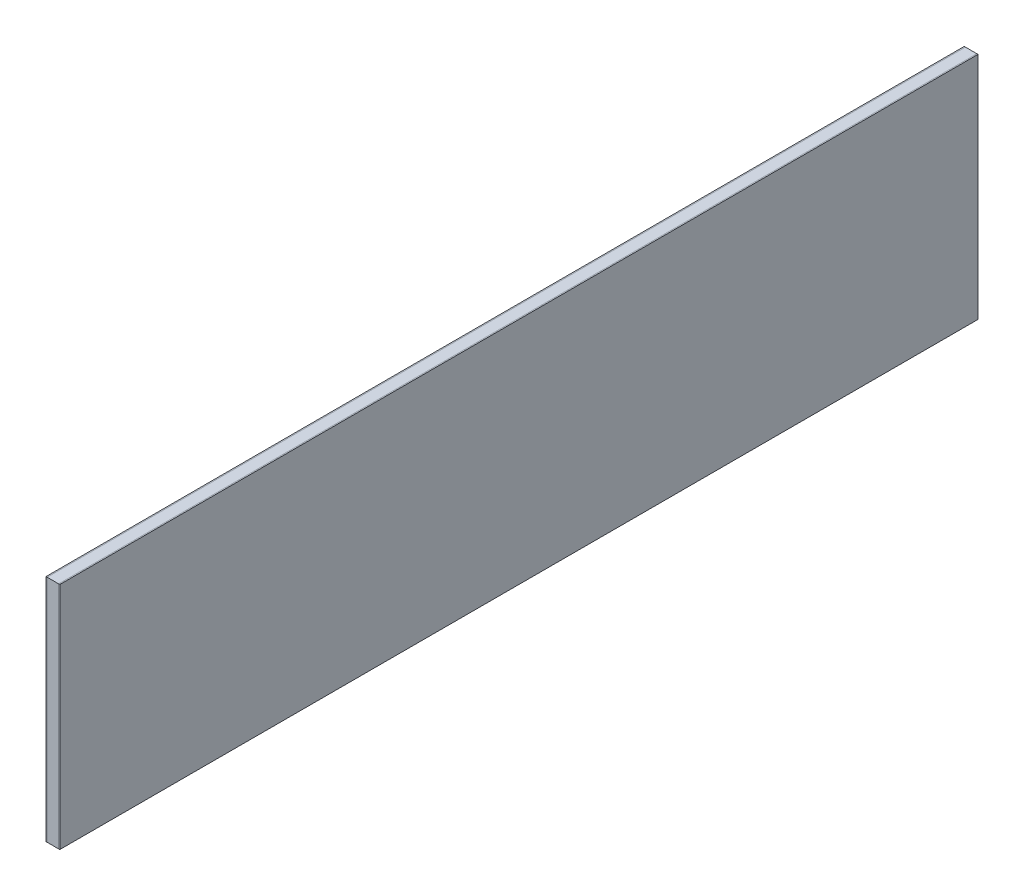
ISO-10303-21;
HEADER;
FILE_DESCRIPTION(('STEP AP214'),'2;1');
FILE_NAME('part.step','',(''),(''),'','','');
FILE_SCHEMA(('AUTOMOTIVE_DESIGN { 1 0 10303 214 1 1 1 1 }'));
ENDSEC;
DATA;
#1=APPLICATION_CONTEXT('core data for automotive mechanical design processes');
#2=APPLICATION_PROTOCOL_DEFINITION('international standard','automotive_design',2000,#1);
#3=PRODUCT_CONTEXT('',#1,'mechanical');
#4=PRODUCT('Part','Part','',(#3));
#5=PRODUCT_RELATED_PRODUCT_CATEGORY('part','',(#4));
#6=PRODUCT_DEFINITION_FORMATION('','',#4);
#7=PRODUCT_DEFINITION_CONTEXT('part definition',#1,'design');
#8=PRODUCT_DEFINITION('design','',#6,#7);
#9=PRODUCT_DEFINITION_SHAPE('','',#8);
#10=(LENGTH_UNIT() NAMED_UNIT(*) SI_UNIT(.MILLI.,.METRE.));
#11=(NAMED_UNIT(*) PLANE_ANGLE_UNIT() SI_UNIT($,.RADIAN.));
#12=(NAMED_UNIT(*) SI_UNIT($,.STERADIAN.) SOLID_ANGLE_UNIT());
#13=UNCERTAINTY_MEASURE_WITH_UNIT(LENGTH_MEASURE(1.E-05),#10,'distance_accuracy_value','');
#14=(GEOMETRIC_REPRESENTATION_CONTEXT(3) GLOBAL_UNCERTAINTY_ASSIGNED_CONTEXT((#13)) GLOBAL_UNIT_ASSIGNED_CONTEXT((#10,
#11,#12)) REPRESENTATION_CONTEXT('',''));
#15=CARTESIAN_POINT('',(0.,0.,0.));
#16=DIRECTION('',(0.,0.,1.));
#17=DIRECTION('',(1.,0.,0.));
#18=AXIS2_PLACEMENT_3D('',#15,#16,#17);
#19=CARTESIAN_POINT('',(-2.75,0.,100.));
#20=DIRECTION('',(0.,0.,-1.));
#21=DIRECTION('',(0.,1.,0.));
#22=AXIS2_PLACEMENT_3D('',#19,#20,#21);
#23=PLANE('',#22);
#24=DIRECTION('',(0.,1.,0.));
#25=VECTOR('',#24,1.);
#26=CARTESIAN_POINT('',(-2.5,0.,100.));
#27=LINE('',#26,#25);
#28=CARTESIAN_POINT('',(-2.5,-25.,100.));
#29=VERTEX_POINT('',#28);
#30=CARTESIAN_POINT('',(-2.5,25.,100.));
#31=VERTEX_POINT('',#30);
#32=EDGE_CURVE('E123',#29,#31,#27,.T.);
#33=ORIENTED_EDGE('',*,*,#32,.T.);
#34=DIRECTION('',(1.,0.,0.));
#35=VECTOR('',#34,1.);
#36=CARTESIAN_POINT('',(-2.75,25.,100.));
#37=LINE('',#36,#35);
#38=CARTESIAN_POINT('',(-2.75,25.,100.));
#39=VERTEX_POINT('',#38);
#40=EDGE_CURVE('E12',#39,#31,#37,.T.);
#41=ORIENTED_EDGE('',*,*,#40,.F.);
#42=DIRECTION('',(0.,1.,0.));
#43=VECTOR('',#42,1.);
#44=CARTESIAN_POINT('',(-2.75,0.,100.));
#45=LINE('',#44,#43);
#46=CARTESIAN_POINT('',(-2.75,-25.,100.));
#47=VERTEX_POINT('',#46);
#48=EDGE_CURVE('E111',#47,#39,#45,.T.);
#49=ORIENTED_EDGE('',*,*,#48,.F.);
#50=DIRECTION('',(1.,0.,0.));
#51=VECTOR('',#50,1.);
#52=CARTESIAN_POINT('',(-2.75,-25.,100.));
#53=LINE('',#52,#51);
#54=EDGE_CURVE('E119',#47,#29,#53,.T.);
#55=ORIENTED_EDGE('',*,*,#54,.T.);
#56=EDGE_LOOP('',(#33,#41,#49,#55));
#57=FACE_BOUND('',#56,.T.);
#58=ADVANCED_FACE('F60',(#57),#23,.F.);
#59=CARTESIAN_POINT('',(-2.75,25.,0.));
#60=DIRECTION('',(0.,-1.,0.));
#61=DIRECTION('',(0.,0.,-1.));
#62=AXIS2_PLACEMENT_3D('',#59,#60,#61);
#63=PLANE('',#62);
#64=DIRECTION('',(0.,0.,-1.));
#65=VECTOR('',#64,1.);
#66=CARTESIAN_POINT('',(-2.5,25.,0.));
#67=LINE('',#66,#65);
#68=CARTESIAN_POINT('',(-2.5,25.,-100.));
#69=VERTEX_POINT('',#68);
#70=EDGE_CURVE('E115',#31,#69,#67,.T.);
#71=ORIENTED_EDGE('',*,*,#70,.T.);
#72=DIRECTION('',(1.,0.,0.));
#73=VECTOR('',#72,1.);
#74=CARTESIAN_POINT('',(-2.75,25.,-100.));
#75=LINE('',#74,#73);
#76=CARTESIAN_POINT('',(-2.75,25.,-100.));
#77=VERTEX_POINT('',#76);
#78=EDGE_CURVE('E68',#77,#69,#75,.T.);
#79=ORIENTED_EDGE('',*,*,#78,.F.);
#80=DIRECTION('',(0.,0.,-1.));
#81=VECTOR('',#80,1.);
#82=CARTESIAN_POINT('',(-2.75,25.,0.));
#83=LINE('',#82,#81);
#84=EDGE_CURVE('E106',#39,#77,#83,.T.);
#85=ORIENTED_EDGE('',*,*,#84,.F.);
#86=ORIENTED_EDGE('',*,*,#40,.T.);
#87=EDGE_LOOP('',(#71,#79,#85,#86));
#88=FACE_BOUND('',#87,.T.);
#89=ADVANCED_FACE('F114',(#88),#63,.F.);
#90=CARTESIAN_POINT('',(-2.75,0.,-100.));
#91=DIRECTION('',(0.,0.,1.));
#92=DIRECTION('',(1.,0.,0.));
#93=AXIS2_PLACEMENT_3D('',#90,#91,#92);
#94=PLANE('',#93);
#95=DIRECTION('',(0.,-1.,0.));
#96=VECTOR('',#95,1.);
#97=CARTESIAN_POINT('',(-2.5,0.,-100.));
#98=LINE('',#97,#96);
#99=CARTESIAN_POINT('',(-2.5,-25.,-99.9999999999999));
#100=VERTEX_POINT('',#99);
#101=EDGE_CURVE('E93',#69,#100,#98,.T.);
#102=ORIENTED_EDGE('',*,*,#101,.T.);
#103=DIRECTION('',(1.,0.,0.));
#104=VECTOR('',#103,1.);
#105=CARTESIAN_POINT('',(-2.75,-25.,-99.9999999999999));
#106=LINE('',#105,#104);
#107=CARTESIAN_POINT('',(-2.75,-25.,-99.9999999999999));
#108=VERTEX_POINT('',#107);
#109=EDGE_CURVE('E116',#108,#100,#106,.T.);
#110=ORIENTED_EDGE('',*,*,#109,.F.);
#111=DIRECTION('',(0.,-1.,0.));
#112=VECTOR('',#111,1.);
#113=CARTESIAN_POINT('',(-2.75,0.,-100.));
#114=LINE('',#113,#112);
#115=EDGE_CURVE('E109',#77,#108,#114,.T.);
#116=ORIENTED_EDGE('',*,*,#115,.F.);
#117=ORIENTED_EDGE('',*,*,#78,.T.);
#118=EDGE_LOOP('',(#102,#110,#116,#117));
#119=FACE_BOUND('',#118,.T.);
#120=ADVANCED_FACE('F117',(#119),#94,.F.);
#121=CARTESIAN_POINT('',(-2.75,-25.,0.));
#122=DIRECTION('',(0.,1.,0.));
#123=DIRECTION('',(0.,0.,1.));
#124=AXIS2_PLACEMENT_3D('',#121,#122,#123);
#125=PLANE('',#124);
#126=DIRECTION('',(0.,0.,1.));
#127=VECTOR('',#126,1.);
#128=CARTESIAN_POINT('',(-2.5,-25.,0.));
#129=LINE('',#128,#127);
#130=EDGE_CURVE('E99',#100,#29,#129,.T.);
#131=ORIENTED_EDGE('',*,*,#130,.T.);
#132=ORIENTED_EDGE('',*,*,#54,.F.);
#133=DIRECTION('',(0.,0.,1.));
#134=VECTOR('',#133,1.);
#135=CARTESIAN_POINT('',(-2.75,-25.,0.));
#136=LINE('',#135,#134);
#137=EDGE_CURVE('E76',#108,#47,#136,.T.);
#138=ORIENTED_EDGE('',*,*,#137,.F.);
#139=ORIENTED_EDGE('',*,*,#109,.T.);
#140=EDGE_LOOP('',(#131,#132,#138,#139));
#141=FACE_BOUND('',#140,.T.);
#142=ADVANCED_FACE('F130',(#141),#125,.F.);
#143=CARTESIAN_POINT('',(-2.75,0.,0.));
#144=DIRECTION('',(-1.,0.,0.));
#145=DIRECTION('',(0.,0.,1.));
#146=AXIS2_PLACEMENT_3D('',#143,#144,#145);
#147=PLANE('',#146);
#148=ORIENTED_EDGE('',*,*,#48,.T.);
#149=ORIENTED_EDGE('',*,*,#84,.T.);
#150=ORIENTED_EDGE('',*,*,#115,.T.);
#151=ORIENTED_EDGE('',*,*,#137,.T.);
#152=EDGE_LOOP('',(#148,#149,#150,#151));
#153=FACE_BOUND('',#152,.T.);
#154=ADVANCED_FACE('F107',(#153),#147,.T.);
#155=CARTESIAN_POINT('',(-2.5,0.,0.));
#156=DIRECTION('',(-1.,0.,0.));
#157=DIRECTION('',(0.,0.,1.));
#158=AXIS2_PLACEMENT_3D('',#155,#156,#157);
#159=PLANE('',#158);
#160=ORIENTED_EDGE('',*,*,#32,.F.);
#161=ORIENTED_EDGE('',*,*,#130,.F.);
#162=ORIENTED_EDGE('',*,*,#101,.F.);
#163=ORIENTED_EDGE('',*,*,#70,.F.);
#164=EDGE_LOOP('',(#160,#161,#162,#163));
#165=FACE_BOUND('',#164,.T.);
#166=ADVANCED_FACE('F133',(#165),#159,.F.);
#167=CLOSED_SHELL('',(#58,#89,#120,#142,#154,#166));
#168=MANIFOLD_SOLID_BREP('B2',#167);
#169=CARTESIAN_POINT('',(-2.5,25.,0.));
#170=DIRECTION('',(0.,-1.,0.));
#171=DIRECTION('',(0.,0.,-1.));
#172=AXIS2_PLACEMENT_3D('',#169,#170,#171);
#173=PLANE('',#172);
#174=DIRECTION('',(0.,0.,-1.));
#175=VECTOR('',#174,1.);
#176=CARTESIAN_POINT('',(0.,25.,0.));
#177=LINE('',#176,#175);
#178=CARTESIAN_POINT('',(0.,25.,100.));
#179=VERTEX_POINT('',#178);
#180=CARTESIAN_POINT('',(0.,25.,-99.9999999999999));
#181=VERTEX_POINT('',#180);
#182=EDGE_CURVE('E273',#179,#181,#177,.T.);
#183=ORIENTED_EDGE('',*,*,#182,.T.);
#184=DIRECTION('',(1.,0.,0.));
#185=VECTOR('',#184,1.);
#186=CARTESIAN_POINT('',(-2.5,25.,-99.9999999999999));
#187=LINE('',#186,#185);
#188=CARTESIAN_POINT('',(-2.5,25.,-99.9999999999999));
#189=VERTEX_POINT('',#188);
#190=EDGE_CURVE('E58',#189,#181,#187,.T.);
#191=ORIENTED_EDGE('',*,*,#190,.F.);
#192=DIRECTION('',(0.,0.,-1.));
#193=VECTOR('',#192,1.);
#194=CARTESIAN_POINT('',(-2.5,25.,0.));
#195=LINE('',#194,#193);
#196=CARTESIAN_POINT('',(-2.5,25.,100.));
#197=VERTEX_POINT('',#196);
#198=EDGE_CURVE('E257',#197,#189,#195,.T.);
#199=ORIENTED_EDGE('',*,*,#198,.F.);
#200=DIRECTION('',(1.,0.,0.));
#201=VECTOR('',#200,1.);
#202=CARTESIAN_POINT('',(-2.5,25.,100.));
#203=LINE('',#202,#201);
#204=EDGE_CURVE('E269',#197,#179,#203,.T.);
#205=ORIENTED_EDGE('',*,*,#204,.T.);
#206=EDGE_LOOP('',(#183,#191,#199,#205));
#207=FACE_BOUND('',#206,.T.);
#208=ADVANCED_FACE('F205',(#207),#173,.F.);
#209=CARTESIAN_POINT('',(-2.5,0.,-100.));
#210=DIRECTION('',(0.,0.,1.));
#211=DIRECTION('',(1.,0.,0.));
#212=AXIS2_PLACEMENT_3D('',#209,#210,#211);
#213=PLANE('',#212);
#214=DIRECTION('',(0.,-1.,0.));
#215=VECTOR('',#214,1.);
#216=CARTESIAN_POINT('',(0.,0.,-100.));
#217=LINE('',#216,#215);
#218=CARTESIAN_POINT('',(0.,-25.,-99.9999999999999));
#219=VERTEX_POINT('',#218);
#220=EDGE_CURVE('E262',#181,#219,#217,.T.);
#221=ORIENTED_EDGE('',*,*,#220,.T.);
#222=DIRECTION('',(1.,0.,0.));
#223=VECTOR('',#222,1.);
#224=CARTESIAN_POINT('',(-2.5,-25.,-99.9999999999999));
#225=LINE('',#224,#223);
#226=CARTESIAN_POINT('',(-2.5,-25.,-99.9999999999999));
#227=VERTEX_POINT('',#226);
#228=EDGE_CURVE('E214',#227,#219,#225,.T.);
#229=ORIENTED_EDGE('',*,*,#228,.F.);
#230=DIRECTION('',(0.,-1.,0.));
#231=VECTOR('',#230,1.);
#232=CARTESIAN_POINT('',(-2.5,0.,-100.));
#233=LINE('',#232,#231);
#234=EDGE_CURVE('E252',#189,#227,#233,.T.);
#235=ORIENTED_EDGE('',*,*,#234,.F.);
#236=ORIENTED_EDGE('',*,*,#190,.T.);
#237=EDGE_LOOP('',(#221,#229,#235,#236));
#238=FACE_BOUND('',#237,.T.);
#239=ADVANCED_FACE('F261',(#238),#213,.F.);
#240=CARTESIAN_POINT('',(-2.5,-25.,0.));
#241=DIRECTION('',(0.,1.,0.));
#242=DIRECTION('',(0.,0.,1.));
#243=AXIS2_PLACEMENT_3D('',#240,#241,#242);
#244=PLANE('',#243);
#245=DIRECTION('',(0.,0.,1.));
#246=VECTOR('',#245,1.);
#247=CARTESIAN_POINT('',(0.,-25.,0.));
#248=LINE('',#247,#246);
#249=CARTESIAN_POINT('',(0.,-25.,100.));
#250=VERTEX_POINT('',#249);
#251=EDGE_CURVE('E239',#219,#250,#248,.T.);
#252=ORIENTED_EDGE('',*,*,#251,.T.);
#253=DIRECTION('',(1.,0.,0.));
#254=VECTOR('',#253,1.);
#255=CARTESIAN_POINT('',(-2.5,-25.,100.));
#256=LINE('',#255,#254);
#257=CARTESIAN_POINT('',(-2.5,-25.,100.));
#258=VERTEX_POINT('',#257);
#259=EDGE_CURVE('E264',#258,#250,#256,.T.);
#260=ORIENTED_EDGE('',*,*,#259,.F.);
#261=DIRECTION('',(0.,0.,1.));
#262=VECTOR('',#261,1.);
#263=CARTESIAN_POINT('',(-2.5,-25.,0.));
#264=LINE('',#263,#262);
#265=EDGE_CURVE('E255',#227,#258,#264,.T.);
#266=ORIENTED_EDGE('',*,*,#265,.F.);
#267=ORIENTED_EDGE('',*,*,#228,.T.);
#268=EDGE_LOOP('',(#252,#260,#266,#267));
#269=FACE_BOUND('',#268,.T.);
#270=ADVANCED_FACE('F265',(#269),#244,.F.);
#271=CARTESIAN_POINT('',(-2.5,0.,100.));
#272=DIRECTION('',(0.,0.,-1.));
#273=DIRECTION('',(0.,1.,0.));
#274=AXIS2_PLACEMENT_3D('',#271,#272,#273);
#275=PLANE('',#274);
#276=DIRECTION('',(0.,1.,0.));
#277=VECTOR('',#276,1.);
#278=CARTESIAN_POINT('',(0.,0.,100.));
#279=LINE('',#278,#277);
#280=EDGE_CURVE('E245',#250,#179,#279,.T.);
#281=ORIENTED_EDGE('',*,*,#280,.T.);
#282=ORIENTED_EDGE('',*,*,#204,.F.);
#283=DIRECTION('',(0.,1.,0.));
#284=VECTOR('',#283,1.);
#285=CARTESIAN_POINT('',(-2.5,0.,100.));
#286=LINE('',#285,#284);
#287=EDGE_CURVE('E222',#258,#197,#286,.T.);
#288=ORIENTED_EDGE('',*,*,#287,.F.);
#289=ORIENTED_EDGE('',*,*,#259,.T.);
#290=EDGE_LOOP('',(#281,#282,#288,#289));
#291=FACE_BOUND('',#290,.T.);
#292=ADVANCED_FACE('F286',(#291),#275,.F.);
#293=CARTESIAN_POINT('',(-2.5,0.,0.));
#294=DIRECTION('',(-1.,0.,0.));
#295=DIRECTION('',(0.,0.,1.));
#296=AXIS2_PLACEMENT_3D('',#293,#294,#295);
#297=PLANE('',#296);
#298=ORIENTED_EDGE('',*,*,#198,.T.);
#299=ORIENTED_EDGE('',*,*,#234,.T.);
#300=ORIENTED_EDGE('',*,*,#265,.T.);
#301=ORIENTED_EDGE('',*,*,#287,.T.);
#302=EDGE_LOOP('',(#298,#299,#300,#301));
#303=FACE_BOUND('',#302,.T.);
#304=ADVANCED_FACE('F253',(#303),#297,.T.);
#305=CARTESIAN_POINT('',(0.,0.,0.));
#306=DIRECTION('',(-1.,0.,0.));
#307=DIRECTION('',(0.,0.,1.));
#308=AXIS2_PLACEMENT_3D('',#305,#306,#307);
#309=PLANE('',#308);
#310=ORIENTED_EDGE('',*,*,#182,.F.);
#311=ORIENTED_EDGE('',*,*,#280,.F.);
#312=ORIENTED_EDGE('',*,*,#251,.F.);
#313=ORIENTED_EDGE('',*,*,#220,.F.);
#314=EDGE_LOOP('',(#310,#311,#312,#313));
#315=FACE_BOUND('',#314,.T.);
#316=ADVANCED_FACE('F289',(#315),#309,.F.);
#317=CLOSED_SHELL('',(#208,#239,#270,#292,#304,#316));
#318=MANIFOLD_SOLID_BREP('B6',#317);
#319=CARTESIAN_POINT('',(0.25,25.,-100.));
#320=DIRECTION('',(0.,0.,1.));
#321=DIRECTION('',(1.,0.,0.));
#322=AXIS2_PLACEMENT_3D('',#319,#320,#321);
#323=PLANE('',#322);
#324=DIRECTION('',(0.,1.,0.));
#325=VECTOR('',#324,1.);
#326=CARTESIAN_POINT('',(0.,25.,-100.));
#327=LINE('',#326,#325);
#328=CARTESIAN_POINT('',(0.,-25.,-100.));
#329=VERTEX_POINT('',#328);
#330=CARTESIAN_POINT('',(0.,25.,-100.));
#331=VERTEX_POINT('',#330);
#332=EDGE_CURVE('E416',#329,#331,#327,.T.);
#333=ORIENTED_EDGE('',*,*,#332,.T.);
#334=DIRECTION('',(-1.,0.,0.));
#335=VECTOR('',#334,1.);
#336=CARTESIAN_POINT('',(0.25,25.,-100.));
#337=LINE('',#336,#335);
#338=CARTESIAN_POINT('',(0.25,25.,-100.));
#339=VERTEX_POINT('',#338);
#340=EDGE_CURVE('E203',#339,#331,#337,.T.);
#341=ORIENTED_EDGE('',*,*,#340,.F.);
#342=DIRECTION('',(0.,1.,0.));
#343=VECTOR('',#342,1.);
#344=CARTESIAN_POINT('',(0.25,25.,-100.));
#345=LINE('',#344,#343);
#346=CARTESIAN_POINT('',(0.25,-25.,-100.));
#347=VERTEX_POINT('',#346);
#348=EDGE_CURVE('E404',#347,#339,#345,.T.);
#349=ORIENTED_EDGE('',*,*,#348,.F.);
#350=DIRECTION('',(-1.,0.,0.));
#351=VECTOR('',#350,1.);
#352=CARTESIAN_POINT('',(0.25,-25.,-100.));
#353=LINE('',#352,#351);
#354=EDGE_CURVE('E412',#347,#329,#353,.T.);
#355=ORIENTED_EDGE('',*,*,#354,.T.);
#356=EDGE_LOOP('',(#333,#341,#349,#355));
#357=FACE_BOUND('',#356,.T.);
#358=ADVANCED_FACE('F353',(#357),#323,.F.);
#359=CARTESIAN_POINT('',(0.25,25.,100.));
#360=DIRECTION('',(0.,-1.,0.));
#361=DIRECTION('',(0.,0.,-1.));
#362=AXIS2_PLACEMENT_3D('',#359,#360,#361);
#363=PLANE('',#362);
#364=DIRECTION('',(0.,0.,1.));
#365=VECTOR('',#364,1.);
#366=CARTESIAN_POINT('',(0.,25.,100.));
#367=LINE('',#366,#365);
#368=CARTESIAN_POINT('',(0.,25.,100.));
#369=VERTEX_POINT('',#368);
#370=EDGE_CURVE('E408',#331,#369,#367,.T.);
#371=ORIENTED_EDGE('',*,*,#370,.T.);
#372=DIRECTION('',(-1.,0.,0.));
#373=VECTOR('',#372,1.);
#374=CARTESIAN_POINT('',(0.25,25.,100.));
#375=LINE('',#374,#373);
#376=CARTESIAN_POINT('',(0.25,25.,100.));
#377=VERTEX_POINT('',#376);
#378=EDGE_CURVE('E361',#377,#369,#375,.T.);
#379=ORIENTED_EDGE('',*,*,#378,.F.);
#380=DIRECTION('',(0.,0.,1.));
#381=VECTOR('',#380,1.);
#382=CARTESIAN_POINT('',(0.25,25.,100.));
#383=LINE('',#382,#381);
#384=EDGE_CURVE('E399',#339,#377,#383,.T.);
#385=ORIENTED_EDGE('',*,*,#384,.F.);
#386=ORIENTED_EDGE('',*,*,#340,.T.);
#387=EDGE_LOOP('',(#371,#379,#385,#386));
#388=FACE_BOUND('',#387,.T.);
#389=ADVANCED_FACE('F407',(#388),#363,.F.);
#390=CARTESIAN_POINT('',(0.25,25.,100.));
#391=DIRECTION('',(0.,0.,-1.));
#392=DIRECTION('',(0.,1.,0.));
#393=AXIS2_PLACEMENT_3D('',#390,#391,#392);
#394=PLANE('',#393);
#395=DIRECTION('',(0.,-1.,0.));
#396=VECTOR('',#395,1.);
#397=CARTESIAN_POINT('',(0.,25.,100.));
#398=LINE('',#397,#396);
#399=CARTESIAN_POINT('',(0.,-25.,100.));
#400=VERTEX_POINT('',#399);
#401=EDGE_CURVE('E386',#369,#400,#398,.T.);
#402=ORIENTED_EDGE('',*,*,#401,.T.);
#403=DIRECTION('',(-1.,0.,0.));
#404=VECTOR('',#403,1.);
#405=CARTESIAN_POINT('',(0.25,-25.,100.));
#406=LINE('',#405,#404);
#407=CARTESIAN_POINT('',(0.25,-25.,100.));
#408=VERTEX_POINT('',#407);
#409=EDGE_CURVE('E409',#408,#400,#406,.T.);
#410=ORIENTED_EDGE('',*,*,#409,.F.);
#411=DIRECTION('',(0.,-1.,0.));
#412=VECTOR('',#411,1.);
#413=CARTESIAN_POINT('',(0.25,25.,100.));
#414=LINE('',#413,#412);
#415=EDGE_CURVE('E402',#377,#408,#414,.T.);
#416=ORIENTED_EDGE('',*,*,#415,.F.);
#417=ORIENTED_EDGE('',*,*,#378,.T.);
#418=EDGE_LOOP('',(#402,#410,#416,#417));
#419=FACE_BOUND('',#418,.T.);
#420=ADVANCED_FACE('F410',(#419),#394,.F.);
#421=CARTESIAN_POINT('',(0.25,-25.,100.));
#422=DIRECTION('',(0.,1.,0.));
#423=DIRECTION('',(0.,0.,1.));
#424=AXIS2_PLACEMENT_3D('',#421,#422,#423);
#425=PLANE('',#424);
#426=DIRECTION('',(0.,0.,-1.));
#427=VECTOR('',#426,1.);
#428=CARTESIAN_POINT('',(0.,-25.,100.));
#429=LINE('',#428,#427);
#430=EDGE_CURVE('E392',#400,#329,#429,.T.);
#431=ORIENTED_EDGE('',*,*,#430,.T.);
#432=ORIENTED_EDGE('',*,*,#354,.F.);
#433=DIRECTION('',(0.,0.,-1.));
#434=VECTOR('',#433,1.);
#435=CARTESIAN_POINT('',(0.25,-25.,100.));
#436=LINE('',#435,#434);
#437=EDGE_CURVE('E369',#408,#347,#436,.T.);
#438=ORIENTED_EDGE('',*,*,#437,.F.);
#439=ORIENTED_EDGE('',*,*,#409,.T.);
#440=EDGE_LOOP('',(#431,#432,#438,#439));
#441=FACE_BOUND('',#440,.T.);
#442=ADVANCED_FACE('F423',(#441),#425,.F.);
#443=CARTESIAN_POINT('',(0.25,0.,0.));
#444=DIRECTION('',(1.,0.,0.));
#445=DIRECTION('',(0.,0.,-1.));
#446=AXIS2_PLACEMENT_3D('',#443,#444,#445);
#447=PLANE('',#446);
#448=ORIENTED_EDGE('',*,*,#348,.T.);
#449=ORIENTED_EDGE('',*,*,#384,.T.);
#450=ORIENTED_EDGE('',*,*,#415,.T.);
#451=ORIENTED_EDGE('',*,*,#437,.T.);
#452=EDGE_LOOP('',(#448,#449,#450,#451));
#453=FACE_BOUND('',#452,.T.);
#454=ADVANCED_FACE('F400',(#453),#447,.T.);
#455=CARTESIAN_POINT('',(0.,0.,0.));
#456=DIRECTION('',(1.,0.,0.));
#457=DIRECTION('',(0.,0.,-1.));
#458=AXIS2_PLACEMENT_3D('',#455,#456,#457);
#459=PLANE('',#458);
#460=ORIENTED_EDGE('',*,*,#332,.F.);
#461=ORIENTED_EDGE('',*,*,#430,.F.);
#462=ORIENTED_EDGE('',*,*,#401,.F.);
#463=ORIENTED_EDGE('',*,*,#370,.F.);
#464=EDGE_LOOP('',(#460,#461,#462,#463));
#465=FACE_BOUND('',#464,.T.);
#466=ADVANCED_FACE('F426',(#465),#459,.F.);
#467=CLOSED_SHELL('',(#358,#389,#420,#442,#454,#466));
#468=MANIFOLD_SOLID_BREP('B52',#467);
#469=ADVANCED_BREP_SHAPE_REPRESENTATION('',(#18,#168,#318,#468),#14);
#470=SHAPE_DEFINITION_REPRESENTATION(#9,#469);
ENDSEC;
END-ISO-10303-21;
